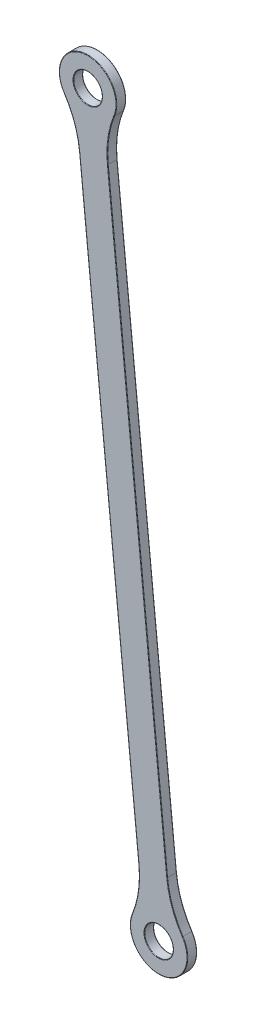
ISO-10303-21;
HEADER;
FILE_DESCRIPTION(('STEP AP214'),'2;1');
FILE_NAME('part.step','',(''),(''),'','','');
FILE_SCHEMA(('AUTOMOTIVE_DESIGN { 1 0 10303 214 1 1 1 1 }'));
ENDSEC;
DATA;
#1=APPLICATION_CONTEXT('core data for automotive mechanical design processes');
#2=APPLICATION_PROTOCOL_DEFINITION('international standard','automotive_design',2000,#1);
#3=PRODUCT_CONTEXT('',#1,'mechanical');
#4=PRODUCT('Part','Part','',(#3));
#5=PRODUCT_RELATED_PRODUCT_CATEGORY('part','',(#4));
#6=PRODUCT_DEFINITION_FORMATION('','',#4);
#7=PRODUCT_DEFINITION_CONTEXT('part definition',#1,'design');
#8=PRODUCT_DEFINITION('design','',#6,#7);
#9=PRODUCT_DEFINITION_SHAPE('','',#8);
#10=(LENGTH_UNIT() NAMED_UNIT(*) SI_UNIT(.MILLI.,.METRE.));
#11=(NAMED_UNIT(*) PLANE_ANGLE_UNIT() SI_UNIT($,.RADIAN.));
#12=(NAMED_UNIT(*) SI_UNIT($,.STERADIAN.) SOLID_ANGLE_UNIT());
#13=UNCERTAINTY_MEASURE_WITH_UNIT(LENGTH_MEASURE(1.E-05),#10,'distance_accuracy_value','');
#14=(GEOMETRIC_REPRESENTATION_CONTEXT(3) GLOBAL_UNCERTAINTY_ASSIGNED_CONTEXT((#13)) GLOBAL_UNIT_ASSIGNED_CONTEXT((#10,
#11,#12)) REPRESENTATION_CONTEXT('',''));
#15=CARTESIAN_POINT('',(0.,0.,0.));
#16=DIRECTION('',(0.,0.,1.));
#17=DIRECTION('',(1.,0.,0.));
#18=AXIS2_PLACEMENT_3D('',#15,#16,#17);
#19=CARTESIAN_POINT('',(26.9745593456508,2.72278490779786,-3.));
#20=DIRECTION('',(-0.994944260506404,-0.100428673621455,0.));
#21=DIRECTION('',(0.100428673621455,-0.994944260506404,0.));
#22=AXIS2_PLACEMENT_3D('',#19,#20,#21);
#23=PLANE('',#22);
#24=DIRECTION('',(0.,0.,-1.));
#25=VECTOR('',#24,1.);
#26=CARTESIAN_POINT('',(17.1507997371631,100.046516135205,-3.));
#27=LINE('',#26,#25);
#28=CARTESIAN_POINT('',(17.1507997371631,100.046516135205,-0.15));
#29=VERTEX_POINT('',#28);
#30=CARTESIAN_POINT('',(17.1507997371631,100.046516135205,-2.85));
#31=VERTEX_POINT('',#30);
#32=EDGE_CURVE('E364',#29,#31,#27,.T.);
#33=ORIENTED_EDGE('',*,*,#32,.T.);
#34=DIRECTION('',(0.100428673621455,-0.994944260506404,0.));
#35=VECTOR('',#34,1.);
#36=CARTESIAN_POINT('',(26.9745593456508,2.72278490779786,-2.85));
#37=LINE('',#36,#35);
#38=CARTESIAN_POINT('',(-1.49146693656855,284.734967759808,-2.85));
#39=VERTEX_POINT('',#38);
#40=EDGE_CURVE('E241',#31,#39,#37,.F.);
#41=ORIENTED_EDGE('',*,*,#40,.T.);
#42=DIRECTION('',(0.,0.,1.));
#43=VECTOR('',#42,1.);
#44=CARTESIAN_POINT('',(-1.49146693656855,284.734967759808,-3.));
#45=LINE('',#44,#43);
#46=CARTESIAN_POINT('',(-1.49146693656855,284.734967759808,-0.15));
#47=VERTEX_POINT('',#46);
#48=EDGE_CURVE('E410',#39,#47,#45,.T.);
#49=ORIENTED_EDGE('',*,*,#48,.T.);
#50=DIRECTION('',(0.100428673621455,-0.994944260506404,0.));
#51=VECTOR('',#50,1.);
#52=CARTESIAN_POINT('',(17.1507997371631,100.046516135205,-0.15));
#53=LINE('',#52,#51);
#54=EDGE_CURVE('E238',#47,#29,#53,.T.);
#55=ORIENTED_EDGE('',*,*,#54,.T.);
#56=EDGE_LOOP('',(#33,#41,#49,#55));
#57=FACE_BOUND('',#56,.T.);
#58=ADVANCED_FACE('F41',(#57),#23,.F.);
#59=CARTESIAN_POINT('',(14.5,81.4999999999992,-3.));
#60=DIRECTION('',(0.,0.,1.));
#61=DIRECTION('',(1.,0.,0.));
#62=AXIS2_PLACEMENT_3D('',#59,#60,#61);
#63=CYLINDRICAL_SURFACE('',#62,9.);
#64=DIRECTION('',(0.,0.,1.));
#65=VECTOR('',#64,1.);
#66=CARTESIAN_POINT('',(6.15722467171074,84.8761071993767,-3.));
#67=LINE('',#66,#65);
#68=CARTESIAN_POINT('',(6.15722467171074,84.8761071993767,-0.15));
#69=VERTEX_POINT('',#68);
#70=CARTESIAN_POINT('',(6.15722467171074,84.8761071993767,-2.85));
#71=VERTEX_POINT('',#70);
#72=EDGE_CURVE('E406',#69,#71,#67,.F.);
#73=ORIENTED_EDGE('',*,*,#72,.T.);
#74=CARTESIAN_POINT('',(14.5,81.4999999999992,-2.85));
#75=DIRECTION('',(0.,0.,1.));
#76=DIRECTION('',(1.,0.,0.));
#77=AXIS2_PLACEMENT_3D('',#74,#75,#76);
#78=CIRCLE('',#77,9.);
#79=CARTESIAN_POINT('',(21.9997986659281,86.4752406947337,-2.85));
#80=VERTEX_POINT('',#79);
#81=EDGE_CURVE('E228',#71,#80,#78,.T.);
#82=ORIENTED_EDGE('',*,*,#81,.T.);
#83=DIRECTION('',(0.,0.,1.));
#84=VECTOR('',#83,1.);
#85=CARTESIAN_POINT('',(21.9997986659281,86.4752406947337,-3.));
#86=LINE('',#85,#84);
#87=CARTESIAN_POINT('',(21.9997986659281,86.4752406947337,-0.15));
#88=VERTEX_POINT('',#87);
#89=EDGE_CURVE('E400',#80,#88,#86,.T.);
#90=ORIENTED_EDGE('',*,*,#89,.T.);
#91=CARTESIAN_POINT('',(14.5,81.4999999999992,-0.15));
#92=DIRECTION('',(0.,0.,1.));
#93=DIRECTION('',(1.,0.,0.));
#94=AXIS2_PLACEMENT_3D('',#91,#92,#93);
#95=CIRCLE('',#94,9.);
#96=EDGE_CURVE('E225',#88,#69,#95,.F.);
#97=ORIENTED_EDGE('',*,*,#96,.T.);
#98=EDGE_LOOP('',(#73,#82,#90,#97));
#99=FACE_BOUND('',#98,.T.);
#100=ADVANCED_FACE('F454',(#99),#63,.T.);
#101=CARTESIAN_POINT('',(18.0200610010932,1.81892684520476,-3.));
#102=DIRECTION('',(-0.994944260506404,-0.100428673621455,0.));
#103=DIRECTION('',(0.100428673621455,-0.994944260506404,0.));
#104=AXIS2_PLACEMENT_3D('',#101,#102,#103);
#105=PLANE('',#104);
#106=DIRECTION('',(0.,0.,-1.));
#107=VECTOR('',#106,1.);
#108=CARTESIAN_POINT('',(-10.4459652811262,283.831109697215,-3.));
#109=LINE('',#108,#107);
#110=CARTESIAN_POINT('',(-10.4459652811262,283.831109697215,-0.15));
#111=VERTEX_POINT('',#110);
#112=CARTESIAN_POINT('',(-10.4459652811262,283.831109697215,-2.85));
#113=VERTEX_POINT('',#112);
#114=EDGE_CURVE('E305',#111,#113,#109,.T.);
#115=ORIENTED_EDGE('',*,*,#114,.T.);
#116=DIRECTION('',(0.100428673621455,-0.994944260506404,0.));
#117=VECTOR('',#116,1.);
#118=CARTESIAN_POINT('',(8.19630139260548,99.1426580726121,-2.85));
#119=LINE('',#118,#117);
#120=CARTESIAN_POINT('',(8.19630139260548,99.1426580726121,-2.85));
#121=VERTEX_POINT('',#120);
#122=EDGE_CURVE('E216',#113,#121,#119,.T.);
#123=ORIENTED_EDGE('',*,*,#122,.T.);
#124=DIRECTION('',(0.,0.,1.));
#125=VECTOR('',#124,1.);
#126=CARTESIAN_POINT('',(8.19630139260548,99.1426580726121,-3.));
#127=LINE('',#126,#125);
#128=CARTESIAN_POINT('',(8.19630139260548,99.1426580726121,-0.15));
#129=VERTEX_POINT('',#128);
#130=EDGE_CURVE('E397',#121,#129,#127,.T.);
#131=ORIENTED_EDGE('',*,*,#130,.T.);
#132=DIRECTION('',(0.100428673621455,-0.994944260506404,0.));
#133=VECTOR('',#132,1.);
#134=CARTESIAN_POINT('',(18.0200610010932,1.81892684520476,-0.15));
#135=LINE('',#134,#133);
#136=EDGE_CURVE('E213',#129,#111,#135,.F.);
#137=ORIENTED_EDGE('',*,*,#136,.T.);
#138=EDGE_LOOP('',(#115,#123,#131,#137));
#139=FACE_BOUND('',#138,.T.);
#140=ADVANCED_FACE('F395',(#139),#105,.T.);
#141=CARTESIAN_POINT('',(14.5,81.4999999999992,-3.));
#142=DIRECTION('',(0.,0.,1.));
#143=DIRECTION('',(1.,0.,0.));
#144=AXIS2_PLACEMENT_3D('',#141,#142,#143);
#145=CYLINDRICAL_SURFACE('',#144,4.5);
#146=CARTESIAN_POINT('',(14.5,81.4999999999992,-2.85));
#147=DIRECTION('',(0.,0.,1.));
#148=DIRECTION('',(1.,0.,0.));
#149=AXIS2_PLACEMENT_3D('',#146,#147,#148);
#150=CIRCLE('',#149,4.5);
#151=CARTESIAN_POINT('',(19.,81.4999999999992,-2.85));
#152=VERTEX_POINT('',#151);
#153=EDGE_CURVE('E204',#152,#152,#150,.F.);
#154=ORIENTED_EDGE('',*,*,#153,.T.);
#155=EDGE_LOOP('',(#154));
#156=FACE_BOUND('',#155,.T.);
#157=CARTESIAN_POINT('',(14.5,81.4999999999992,-0.15));
#158=DIRECTION('',(0.,0.,1.));
#159=DIRECTION('',(1.,0.,0.));
#160=AXIS2_PLACEMENT_3D('',#157,#158,#159);
#161=CIRCLE('',#160,4.5);
#162=CARTESIAN_POINT('',(19.,81.4999999999992,-0.15));
#163=VERTEX_POINT('',#162);
#164=EDGE_CURVE('E200',#163,#163,#161,.T.);
#165=ORIENTED_EDGE('',*,*,#164,.T.);
#166=EDGE_LOOP('',(#165));
#167=FACE_BOUND('',#166,.T.);
#168=ADVANCED_FACE('F706',(#156,#167),#145,.F.);
#169=CARTESIAN_POINT('',(-7.79516554396304,302.377625832421,-3.));
#170=DIRECTION('',(0.,0.,1.));
#171=DIRECTION('',(1.,0.,0.));
#172=AXIS2_PLACEMENT_3D('',#169,#170,#171);
#173=CYLINDRICAL_SURFACE('',#172,9.00000000000001);
#174=DIRECTION('',(0.,0.,1.));
#175=VECTOR('',#174,1.);
#176=CARTESIAN_POINT('',(0.547609784326176,299.001518633043,-3.));
#177=LINE('',#176,#175);
#178=CARTESIAN_POINT('',(0.547609784326176,299.001518633043,-0.15));
#179=VERTEX_POINT('',#178);
#180=CARTESIAN_POINT('',(0.547609784326176,299.001518633043,-2.85));
#181=VERTEX_POINT('',#180);
#182=EDGE_CURVE('E358',#179,#181,#177,.F.);
#183=ORIENTED_EDGE('',*,*,#182,.T.);
#184=CARTESIAN_POINT('',(-7.79516554396304,302.377625832421,-2.85));
#185=DIRECTION('',(0.,0.,1.));
#186=DIRECTION('',(1.,0.,0.));
#187=AXIS2_PLACEMENT_3D('',#184,#185,#186);
#188=CIRCLE('',#187,9.00000000000001);
#189=CARTESIAN_POINT('',(-15.2949642098912,297.402385137686,-2.85));
#190=VERTEX_POINT('',#189);
#191=EDGE_CURVE('E253',#181,#190,#188,.T.);
#192=ORIENTED_EDGE('',*,*,#191,.T.);
#193=DIRECTION('',(0.,0.,1.));
#194=VECTOR('',#193,1.);
#195=CARTESIAN_POINT('',(-15.2949642098912,297.402385137686,-3.));
#196=LINE('',#195,#194);
#197=CARTESIAN_POINT('',(-15.2949642098912,297.402385137686,-0.15));
#198=VERTEX_POINT('',#197);
#199=EDGE_CURVE('E350',#190,#198,#196,.T.);
#200=ORIENTED_EDGE('',*,*,#199,.T.);
#201=CARTESIAN_POINT('',(-7.79516554396304,302.377625832421,-0.15));
#202=DIRECTION('',(0.,0.,1.));
#203=DIRECTION('',(1.,0.,0.));
#204=AXIS2_PLACEMENT_3D('',#201,#202,#203);
#205=CIRCLE('',#204,9.00000000000001);
#206=EDGE_CURVE('E250',#198,#179,#205,.F.);
#207=ORIENTED_EDGE('',*,*,#206,.T.);
#208=EDGE_LOOP('',(#183,#192,#200,#207));
#209=FACE_BOUND('',#208,.T.);
#210=ADVANCED_FACE('F354',(#209),#173,.T.);
#211=CARTESIAN_POINT('',(-7.79516554396304,302.377625832421,-3.));
#212=DIRECTION('',(0.,0.,1.));
#213=DIRECTION('',(1.,0.,0.));
#214=AXIS2_PLACEMENT_3D('',#211,#212,#213);
#215=CYLINDRICAL_SURFACE('',#214,4.5);
#216=CARTESIAN_POINT('',(-7.79516554396304,302.377625832421,-2.85));
#217=DIRECTION('',(0.,0.,1.));
#218=DIRECTION('',(1.,0.,0.));
#219=AXIS2_PLACEMENT_3D('',#216,#217,#218);
#220=CIRCLE('',#219,4.5);
#221=CARTESIAN_POINT('',(-3.29516554396304,302.377625832421,-2.85));
#222=VERTEX_POINT('',#221);
#223=EDGE_CURVE('E179',#222,#222,#220,.F.);
#224=ORIENTED_EDGE('',*,*,#223,.T.);
#225=EDGE_LOOP('',(#224));
#226=FACE_BOUND('',#225,.T.);
#227=CARTESIAN_POINT('',(-7.79516554396304,302.377625832421,-0.15));
#228=DIRECTION('',(0.,0.,1.));
#229=DIRECTION('',(1.,0.,0.));
#230=AXIS2_PLACEMENT_3D('',#227,#228,#229);
#231=CIRCLE('',#230,4.5);
#232=CARTESIAN_POINT('',(-3.29516554396304,302.377625832421,-0.15));
#233=VERTEX_POINT('',#232);
#234=EDGE_CURVE('E357',#233,#233,#231,.T.);
#235=ORIENTED_EDGE('',*,*,#234,.T.);
#236=EDGE_LOOP('',(#235));
#237=FACE_BOUND('',#236,.T.);
#238=ADVANCED_FACE('F684',(#226,#237),#215,.F.);
#239=CARTESIAN_POINT('',(0.,0.,-3.));
#240=DIRECTION('',(0.,0.,1.));
#241=DIRECTION('',(1.,0.,0.));
#242=AXIS2_PLACEMENT_3D('',#239,#240,#241);
#243=PLANE('',#242);
#244=CARTESIAN_POINT('',(-7.79516554396304,302.377625832421,-3.));
#245=DIRECTION('',(0.,0.,1.));
#246=DIRECTION('',(1.,0.,0.));
#247=AXIS2_PLACEMENT_3D('',#244,#245,#246);
#248=CIRCLE('',#247,4.65);
#249=CARTESIAN_POINT('',(-3.14516554396304,302.377625832421,-3.));
#250=VERTEX_POINT('',#249);
#251=EDGE_CURVE('E191',#250,#250,#248,.T.);
#252=ORIENTED_EDGE('',*,*,#251,.T.);
#253=EDGE_LOOP('',(#252));
#254=FACE_BOUND('',#253,.T.);
#255=CARTESIAN_POINT('',(14.5,81.4999999999992,-3.));
#256=DIRECTION('',(0.,0.,1.));
#257=DIRECTION('',(1.,0.,0.));
#258=AXIS2_PLACEMENT_3D('',#255,#256,#257);
#259=CIRCLE('',#258,4.65);
#260=CARTESIAN_POINT('',(19.15,81.4999999999992,-3.));
#261=VERTEX_POINT('',#260);
#262=EDGE_CURVE('E186',#261,#261,#259,.T.);
#263=ORIENTED_EDGE('',*,*,#262,.T.);
#264=EDGE_LOOP('',(#263));
#265=FACE_BOUND('',#264,.T.);
#266=DIRECTION('',(0.100428673621455,-0.994944260506404,0.));
#267=VECTOR('',#266,1.);
#268=CARTESIAN_POINT('',(-10.2967236420502,283.846173998258,-3.));
#269=LINE('',#268,#267);
#270=CARTESIAN_POINT('',(8.34554303168144,99.1577223736553,-3.));
#271=VERTEX_POINT('',#270);
#272=CARTESIAN_POINT('',(-10.2967236420502,283.846173998258,-3.));
#273=VERTEX_POINT('',#272);
#274=EDGE_CURVE('E183',#271,#273,#269,.F.);
#275=ORIENTED_EDGE('',*,*,#274,.T.);
#276=CARTESIAN_POINT('',(-40.2942930963183,280.818249488571,-3.));
#277=DIRECTION('',(0.,0.,1.));
#278=DIRECTION('',(1.,0.,0.));
#279=AXIS2_PLACEMENT_3D('',#276,#277,#278);
#280=CIRCLE('',#279,30.15);
#281=CARTESIAN_POINT('',(-15.169967565459,297.485305815932,-3.));
#282=VERTEX_POINT('',#281);
#283=EDGE_CURVE('E162',#273,#282,#280,.T.);
#284=ORIENTED_EDGE('',*,*,#283,.T.);
#285=CARTESIAN_POINT('',(-7.79516554396304,302.377625832421,-3.));
#286=DIRECTION('',(0.,0.,1.));
#287=DIRECTION('',(1.,0.,0.));
#288=AXIS2_PLACEMENT_3D('',#285,#286,#287);
#289=CIRCLE('',#288,8.85);
#290=CARTESIAN_POINT('',(0.408563528854686,299.057787086366,-3.));
#291=VERTEX_POINT('',#290);
#292=EDGE_CURVE('E171',#282,#291,#289,.F.);
#293=ORIENTED_EDGE('',*,*,#292,.T.);
#294=CARTESIAN_POINT('',(28.3568608786236,287.747827968452,-3.));
#295=DIRECTION('',(0.,0.,1.));
#296=DIRECTION('',(1.,0.,0.));
#297=AXIS2_PLACEMENT_3D('',#294,#295,#296);
#298=CIRCLE('',#297,30.15);
#299=CARTESIAN_POINT('',(-1.64070857564451,284.719903458765,-3.));
#300=VERTEX_POINT('',#299);
#301=EDGE_CURVE('E178',#291,#300,#298,.T.);
#302=ORIENTED_EDGE('',*,*,#301,.T.);
#303=DIRECTION('',(0.100428673621455,-0.994944260506404,0.));
#304=VECTOR('',#303,1.);
#305=CARTESIAN_POINT('',(26.8253177065749,2.70772060675464,-3.));
#306=LINE('',#305,#304);
#307=CARTESIAN_POINT('',(17.0015580980872,100.031451834162,-3.));
#308=VERTEX_POINT('',#307);
#309=EDGE_CURVE('E373',#300,#308,#306,.T.);
#310=ORIENTED_EDGE('',*,*,#309,.T.);
#311=CARTESIAN_POINT('',(46.9991275523552,103.059376343849,-3.));
#312=DIRECTION('',(0.,0.,1.));
#313=DIRECTION('',(1.,0.,0.));
#314=AXIS2_PLACEMENT_3D('',#311,#312,#313);
#315=CIRCLE('',#314,30.15);
#316=CARTESIAN_POINT('',(21.874802021496,86.3923200164881,-3.));
#317=VERTEX_POINT('',#316);
#318=EDGE_CURVE('E376',#308,#317,#315,.T.);
#319=ORIENTED_EDGE('',*,*,#318,.T.);
#320=CARTESIAN_POINT('',(14.5,81.4999999999992,-3.));
#321=DIRECTION('',(0.,0.,1.));
#322=DIRECTION('',(1.,0.,0.));
#323=AXIS2_PLACEMENT_3D('',#320,#321,#322);
#324=CIRCLE('',#323,8.85);
#325=CARTESIAN_POINT('',(6.29627092718222,84.8198387460537,-3.));
#326=VERTEX_POINT('',#325);
#327=EDGE_CURVE('E379',#317,#326,#324,.F.);
#328=ORIENTED_EDGE('',*,*,#327,.T.);
#329=CARTESIAN_POINT('',(-21.6520264225866,96.1297978639685,-3.));
#330=DIRECTION('',(0.,0.,1.));
#331=DIRECTION('',(1.,0.,0.));
#332=AXIS2_PLACEMENT_3D('',#329,#330,#331);
#333=CIRCLE('',#332,30.15);
#334=EDGE_CURVE('E193',#326,#271,#333,.T.);
#335=ORIENTED_EDGE('',*,*,#334,.T.);
#336=EDGE_LOOP('',(#275,#284,#293,#302,#310,#319,#328,#335));
#337=FACE_BOUND('',#336,.T.);
#338=ADVANCED_FACE('F181',(#254,#265,#337),#243,.F.);
#339=CARTESIAN_POINT('',(0.,0.,0.));
#340=DIRECTION('',(0.,0.,1.));
#341=DIRECTION('',(1.,0.,0.));
#342=AXIS2_PLACEMENT_3D('',#339,#340,#341);
#343=PLANE('',#342);
#344=CARTESIAN_POINT('',(-7.79516554396304,302.377625832421,0.));
#345=DIRECTION('',(0.,0.,1.));
#346=DIRECTION('',(1.,0.,0.));
#347=AXIS2_PLACEMENT_3D('',#344,#345,#346);
#348=CIRCLE('',#347,4.65);
#349=CARTESIAN_POINT('',(-3.14516554396304,302.377625832421,0.));
#350=VERTEX_POINT('',#349);
#351=EDGE_CURVE('E11',#350,#350,#348,.F.);
#352=ORIENTED_EDGE('',*,*,#351,.T.);
#353=EDGE_LOOP('',(#352));
#354=FACE_BOUND('',#353,.T.);
#355=CARTESIAN_POINT('',(14.5,81.4999999999992,0.));
#356=DIRECTION('',(0.,0.,1.));
#357=DIRECTION('',(1.,0.,0.));
#358=AXIS2_PLACEMENT_3D('',#355,#356,#357);
#359=CIRCLE('',#358,4.65);
#360=CARTESIAN_POINT('',(19.15,81.4999999999992,0.));
#361=VERTEX_POINT('',#360);
#362=EDGE_CURVE('E51',#361,#361,#359,.F.);
#363=ORIENTED_EDGE('',*,*,#362,.T.);
#364=EDGE_LOOP('',(#363));
#365=FACE_BOUND('',#364,.T.);
#366=CARTESIAN_POINT('',(14.5,81.4999999999992,0.));
#367=DIRECTION('',(0.,0.,1.));
#368=DIRECTION('',(1.,0.,0.));
#369=AXIS2_PLACEMENT_3D('',#366,#367,#368);
#370=CIRCLE('',#369,8.85);
#371=CARTESIAN_POINT('',(6.29627092718223,84.8198387460537,0.));
#372=VERTEX_POINT('',#371);
#373=CARTESIAN_POINT('',(21.874802021496,86.3923200164881,0.));
#374=VERTEX_POINT('',#373);
#375=EDGE_CURVE('E59',#372,#374,#370,.T.);
#376=ORIENTED_EDGE('',*,*,#375,.T.);
#377=CARTESIAN_POINT('',(46.9991275523552,103.059376343849,0.));
#378=DIRECTION('',(0.,0.,1.));
#379=DIRECTION('',(1.,0.,0.));
#380=AXIS2_PLACEMENT_3D('',#377,#378,#379);
#381=CIRCLE('',#380,30.15);
#382=CARTESIAN_POINT('',(17.0015580980872,100.031451834162,0.));
#383=VERTEX_POINT('',#382);
#384=EDGE_CURVE('E275',#374,#383,#381,.F.);
#385=ORIENTED_EDGE('',*,*,#384,.T.);
#386=DIRECTION('',(0.100428673621455,-0.994944260506404,0.));
#387=VECTOR('',#386,1.);
#388=CARTESIAN_POINT('',(-1.64070857564452,284.719903458765,0.));
#389=LINE('',#388,#387);
#390=CARTESIAN_POINT('',(-1.64070857564452,284.719903458765,0.));
#391=VERTEX_POINT('',#390);
#392=EDGE_CURVE('E256',#383,#391,#389,.F.);
#393=ORIENTED_EDGE('',*,*,#392,.T.);
#394=CARTESIAN_POINT('',(28.3568608786236,287.747827968452,0.));
#395=DIRECTION('',(0.,0.,1.));
#396=DIRECTION('',(1.,0.,0.));
#397=AXIS2_PLACEMENT_3D('',#394,#395,#396);
#398=CIRCLE('',#397,30.15);
#399=CARTESIAN_POINT('',(0.408563528854681,299.057787086366,0.));
#400=VERTEX_POINT('',#399);
#401=EDGE_CURVE('E259',#391,#400,#398,.F.);
#402=ORIENTED_EDGE('',*,*,#401,.T.);
#403=CARTESIAN_POINT('',(-7.79516554396304,302.377625832421,0.));
#404=DIRECTION('',(0.,0.,1.));
#405=DIRECTION('',(1.,0.,0.));
#406=AXIS2_PLACEMENT_3D('',#403,#404,#405);
#407=CIRCLE('',#406,8.85);
#408=CARTESIAN_POINT('',(-15.169967565459,297.485305815932,0.));
#409=VERTEX_POINT('',#408);
#410=EDGE_CURVE('E262',#400,#409,#407,.T.);
#411=ORIENTED_EDGE('',*,*,#410,.T.);
#412=CARTESIAN_POINT('',(-40.2942930963183,280.818249488571,0.));
#413=DIRECTION('',(0.,0.,1.));
#414=DIRECTION('',(1.,0.,0.));
#415=AXIS2_PLACEMENT_3D('',#412,#413,#414);
#416=CIRCLE('',#415,30.15);
#417=CARTESIAN_POINT('',(-10.2967236420502,283.846173998258,0.));
#418=VERTEX_POINT('',#417);
#419=EDGE_CURVE('E265',#409,#418,#416,.F.);
#420=ORIENTED_EDGE('',*,*,#419,.T.);
#421=DIRECTION('',(0.100428673621455,-0.994944260506404,0.));
#422=VECTOR('',#421,1.);
#423=CARTESIAN_POINT('',(18.1693026401692,1.83399114624798,0.));
#424=LINE('',#423,#422);
#425=CARTESIAN_POINT('',(8.34554303168144,99.1577223736553,0.));
#426=VERTEX_POINT('',#425);
#427=EDGE_CURVE('E268',#418,#426,#424,.T.);
#428=ORIENTED_EDGE('',*,*,#427,.T.);
#429=CARTESIAN_POINT('',(-21.6520264225866,96.1297978639685,0.));
#430=DIRECTION('',(0.,0.,1.));
#431=DIRECTION('',(1.,0.,0.));
#432=AXIS2_PLACEMENT_3D('',#429,#430,#431);
#433=CIRCLE('',#432,30.15);
#434=EDGE_CURVE('E64',#426,#372,#433,.F.);
#435=ORIENTED_EDGE('',*,*,#434,.T.);
#436=EDGE_LOOP('',(#376,#385,#393,#402,#411,#420,#428,#435));
#437=FACE_BOUND('',#436,.T.);
#438=ADVANCED_FACE('F480',(#354,#365,#437),#343,.T.);
#439=CARTESIAN_POINT('',(-21.6520264225866,96.1297978639685,-3.));
#440=DIRECTION('',(0.,0.,1.));
#441=DIRECTION('',(1.,0.,0.));
#442=AXIS2_PLACEMENT_3D('',#439,#440,#441);
#443=CYLINDRICAL_SURFACE('',#442,30.);
#444=ORIENTED_EDGE('',*,*,#130,.F.);
#445=CARTESIAN_POINT('',(-21.6520264225866,96.1297978639685,-2.85));
#446=DIRECTION('',(0.,0.,1.));
#447=DIRECTION('',(1.,0.,0.));
#448=AXIS2_PLACEMENT_3D('',#445,#446,#447);
#449=CIRCLE('',#448,30.);
#450=EDGE_CURVE('E222',#121,#71,#449,.F.);
#451=ORIENTED_EDGE('',*,*,#450,.T.);
#452=ORIENTED_EDGE('',*,*,#72,.F.);
#453=CARTESIAN_POINT('',(-21.6520264225866,96.1297978639685,-0.15));
#454=DIRECTION('',(0.,0.,1.));
#455=DIRECTION('',(1.,0.,0.));
#456=AXIS2_PLACEMENT_3D('',#453,#454,#455);
#457=CIRCLE('',#456,30.);
#458=EDGE_CURVE('E219',#69,#129,#457,.T.);
#459=ORIENTED_EDGE('',*,*,#458,.T.);
#460=EDGE_LOOP('',(#444,#451,#452,#459));
#461=FACE_BOUND('',#460,.T.);
#462=ADVANCED_FACE('F477',(#461),#443,.F.);
#463=CARTESIAN_POINT('',(46.9991275523552,103.059376343849,-3.));
#464=DIRECTION('',(0.,0.,1.));
#465=DIRECTION('',(1.,0.,0.));
#466=AXIS2_PLACEMENT_3D('',#463,#464,#465);
#467=CYLINDRICAL_SURFACE('',#466,30.);
#468=ORIENTED_EDGE('',*,*,#89,.F.);
#469=CARTESIAN_POINT('',(46.9991275523552,103.059376343849,-2.85));
#470=DIRECTION('',(0.,0.,1.));
#471=DIRECTION('',(1.,0.,0.));
#472=AXIS2_PLACEMENT_3D('',#469,#470,#471);
#473=CIRCLE('',#472,30.);
#474=EDGE_CURVE('E235',#80,#31,#473,.F.);
#475=ORIENTED_EDGE('',*,*,#474,.T.);
#476=ORIENTED_EDGE('',*,*,#32,.F.);
#477=CARTESIAN_POINT('',(46.9991275523552,103.059376343849,-0.15));
#478=DIRECTION('',(0.,0.,1.));
#479=DIRECTION('',(1.,0.,0.));
#480=AXIS2_PLACEMENT_3D('',#477,#478,#479);
#481=CIRCLE('',#480,30.);
#482=EDGE_CURVE('E231',#29,#88,#481,.T.);
#483=ORIENTED_EDGE('',*,*,#482,.T.);
#484=EDGE_LOOP('',(#468,#475,#476,#483));
#485=FACE_BOUND('',#484,.T.);
#486=ADVANCED_FACE('F452',(#485),#467,.F.);
#487=CARTESIAN_POINT('',(-40.2942930963183,280.818249488571,-3.));
#488=DIRECTION('',(0.,0.,1.));
#489=DIRECTION('',(1.,0.,0.));
#490=AXIS2_PLACEMENT_3D('',#487,#488,#489);
#491=CYLINDRICAL_SURFACE('',#490,30.);
#492=ORIENTED_EDGE('',*,*,#199,.F.);
#493=CARTESIAN_POINT('',(-40.2942930963183,280.818249488571,-2.85));
#494=DIRECTION('',(0.,0.,1.));
#495=DIRECTION('',(1.,0.,0.));
#496=AXIS2_PLACEMENT_3D('',#493,#494,#495);
#497=CIRCLE('',#496,30.);
#498=EDGE_CURVE('E164',#190,#113,#497,.F.);
#499=ORIENTED_EDGE('',*,*,#498,.T.);
#500=ORIENTED_EDGE('',*,*,#114,.F.);
#501=CARTESIAN_POINT('',(-40.2942930963183,280.818249488571,-0.15));
#502=DIRECTION('',(0.,0.,1.));
#503=DIRECTION('',(1.,0.,0.));
#504=AXIS2_PLACEMENT_3D('',#501,#502,#503);
#505=CIRCLE('',#504,30.);
#506=EDGE_CURVE('E208',#111,#198,#505,.T.);
#507=ORIENTED_EDGE('',*,*,#506,.T.);
#508=EDGE_LOOP('',(#492,#499,#500,#507));
#509=FACE_BOUND('',#508,.T.);
#510=ADVANCED_FACE('F349',(#509),#491,.F.);
#511=CARTESIAN_POINT('',(28.3568608786236,287.747827968452,-3.));
#512=DIRECTION('',(0.,0.,1.));
#513=DIRECTION('',(1.,0.,0.));
#514=AXIS2_PLACEMENT_3D('',#511,#512,#513);
#515=CYLINDRICAL_SURFACE('',#514,30.);
#516=ORIENTED_EDGE('',*,*,#48,.F.);
#517=CARTESIAN_POINT('',(28.3568608786236,287.747827968452,-2.85));
#518=DIRECTION('',(0.,0.,1.));
#519=DIRECTION('',(1.,0.,0.));
#520=AXIS2_PLACEMENT_3D('',#517,#518,#519);
#521=CIRCLE('',#520,30.);
#522=EDGE_CURVE('E247',#39,#181,#521,.F.);
#523=ORIENTED_EDGE('',*,*,#522,.T.);
#524=ORIENTED_EDGE('',*,*,#182,.F.);
#525=CARTESIAN_POINT('',(28.3568608786236,287.747827968452,-0.15));
#526=DIRECTION('',(0.,0.,1.));
#527=DIRECTION('',(1.,0.,0.));
#528=AXIS2_PLACEMENT_3D('',#525,#526,#527);
#529=CIRCLE('',#528,30.);
#530=EDGE_CURVE('E244',#179,#47,#529,.T.);
#531=ORIENTED_EDGE('',*,*,#530,.T.);
#532=EDGE_LOOP('',(#516,#523,#524,#531));
#533=FACE_BOUND('',#532,.T.);
#534=ADVANCED_FACE('F436',(#533),#515,.F.);
#535=CARTESIAN_POINT('',(-7.79516554396304,302.377625832421,-2.85));
#536=DIRECTION('',(0.,0.,1.));
#537=DIRECTION('',(1.,0.,0.));
#538=AXIS2_PLACEMENT_3D('',#535,#536,#537);
#539=TOROIDAL_SURFACE('',#538,4.65,0.15);
#540=ORIENTED_EDGE('',*,*,#251,.F.);
#541=EDGE_LOOP('',(#540));
#542=FACE_BOUND('',#541,.T.);
#543=ORIENTED_EDGE('',*,*,#223,.F.);
#544=EDGE_LOOP('',(#543));
#545=FACE_BOUND('',#544,.T.);
#546=ADVANCED_FACE('F488',(#542,#545),#539,.T.);
#547=CARTESIAN_POINT('',(14.5,81.4999999999992,-2.85));
#548=DIRECTION('',(0.,0.,1.));
#549=DIRECTION('',(1.,0.,0.));
#550=AXIS2_PLACEMENT_3D('',#547,#548,#549);
#551=TOROIDAL_SURFACE('',#550,4.65,0.15);
#552=ORIENTED_EDGE('',*,*,#153,.F.);
#553=EDGE_LOOP('',(#552));
#554=FACE_BOUND('',#553,.T.);
#555=ORIENTED_EDGE('',*,*,#262,.F.);
#556=EDGE_LOOP('',(#555));
#557=FACE_BOUND('',#556,.T.);
#558=ADVANCED_FACE('F466',(#554,#557),#551,.T.);
#559=CARTESIAN_POINT('',(46.9991275523552,103.059376343849,-2.85));
#560=DIRECTION('',(0.,0.,1.));
#561=DIRECTION('',(1.,0.,0.));
#562=AXIS2_PLACEMENT_3D('',#559,#560,#561);
#563=TOROIDAL_SURFACE('',#562,30.15,0.15);
#564=CARTESIAN_POINT('',(17.0015580980871,100.031451834162,-2.85));
#565=DIRECTION('',(-0.100428673621423,0.994944260506407,0.));
#566=DIRECTION('',(-0.994944260506407,-0.100428673621423,0.));
#567=AXIS2_PLACEMENT_3D('',#564,#565,#566);
#568=CIRCLE('',#567,0.15);
#569=EDGE_CURVE('E297',#31,#308,#568,.T.);
#570=ORIENTED_EDGE('',*,*,#569,.F.);
#571=ORIENTED_EDGE('',*,*,#474,.F.);
#572=CARTESIAN_POINT('',(21.874802021496,86.3923200164881,-2.85));
#573=DIRECTION('',(0.552804521637141,-0.833310962880923,0.));
#574=DIRECTION('',(0.833310962880924,0.552804521637141,0.));
#575=AXIS2_PLACEMENT_3D('',#572,#573,#574);
#576=CIRCLE('',#575,0.15);
#577=EDGE_CURVE('E301',#317,#80,#576,.T.);
#578=ORIENTED_EDGE('',*,*,#577,.F.);
#579=ORIENTED_EDGE('',*,*,#318,.F.);
#580=EDGE_LOOP('',(#570,#571,#578,#579));
#581=FACE_BOUND('',#580,.T.);
#582=ADVANCED_FACE('F426',(#581),#563,.T.);
#583=CARTESIAN_POINT('',(14.5,81.4999999999992,-2.85));
#584=DIRECTION('',(0.,0.,1.));
#585=DIRECTION('',(1.,0.,0.));
#586=AXIS2_PLACEMENT_3D('',#583,#584,#585);
#587=TOROIDAL_SURFACE('',#586,8.85,0.15);
#588=ORIENTED_EDGE('',*,*,#577,.T.);
#589=ORIENTED_EDGE('',*,*,#81,.F.);
#590=CARTESIAN_POINT('',(6.29627092718222,84.8198387460537,-2.85));
#591=DIRECTION('',(0.375123022153069,0.926975036476575,0.));
#592=DIRECTION('',(-0.926975036476575,0.375123022153069,0.));
#593=AXIS2_PLACEMENT_3D('',#590,#591,#592);
#594=CIRCLE('',#593,0.15);
#595=EDGE_CURVE('E293',#326,#71,#594,.T.);
#596=ORIENTED_EDGE('',*,*,#595,.F.);
#597=ORIENTED_EDGE('',*,*,#327,.F.);
#598=EDGE_LOOP('',(#588,#589,#596,#597));
#599=FACE_BOUND('',#598,.T.);
#600=ADVANCED_FACE('F458',(#599),#587,.T.);
#601=CARTESIAN_POINT('',(26.8253177065749,2.70772060675464,-2.85));
#602=DIRECTION('',(0.100428673621455,-0.994944260506404,0.));
#603=DIRECTION('',(0.994944260506404,0.100428673621455,0.));
#604=AXIS2_PLACEMENT_3D('',#601,#602,#603);
#605=CYLINDRICAL_SURFACE('',#604,0.15);
#606=ORIENTED_EDGE('',*,*,#569,.T.);
#607=ORIENTED_EDGE('',*,*,#309,.F.);
#608=CARTESIAN_POINT('',(-1.64070857564451,284.719903458765,-2.85));
#609=DIRECTION('',(-0.100428673621331,0.994944260506417,0.));
#610=DIRECTION('',(-0.994944260506417,-0.100428673621331,0.));
#611=AXIS2_PLACEMENT_3D('',#608,#609,#610);
#612=CIRCLE('',#611,0.15);
#613=EDGE_CURVE('E289',#39,#300,#612,.T.);
#614=ORIENTED_EDGE('',*,*,#613,.F.);
#615=ORIENTED_EDGE('',*,*,#40,.F.);
#616=EDGE_LOOP('',(#606,#607,#614,#615));
#617=FACE_BOUND('',#616,.T.);
#618=ADVANCED_FACE('F431',(#617),#605,.T.);
#619=CARTESIAN_POINT('',(-21.6520264225866,96.1297978639685,-2.85));
#620=DIRECTION('',(0.,0.,1.));
#621=DIRECTION('',(1.,0.,0.));
#622=AXIS2_PLACEMENT_3D('',#619,#620,#621);
#623=TOROIDAL_SURFACE('',#622,30.15,0.15);
#624=ORIENTED_EDGE('',*,*,#595,.T.);
#625=ORIENTED_EDGE('',*,*,#450,.F.);
#626=CARTESIAN_POINT('',(8.34554303168144,99.1577223736553,-2.85));
#627=DIRECTION('',(-0.10042867362142,0.994944260506407,0.));
#628=DIRECTION('',(-0.994944260506408,-0.100428673621421,0.));
#629=AXIS2_PLACEMENT_3D('',#626,#627,#628);
#630=CIRCLE('',#629,0.15);
#631=EDGE_CURVE('E285',#271,#121,#630,.T.);
#632=ORIENTED_EDGE('',*,*,#631,.F.);
#633=ORIENTED_EDGE('',*,*,#334,.F.);
#634=EDGE_LOOP('',(#624,#625,#632,#633));
#635=FACE_BOUND('',#634,.T.);
#636=ADVANCED_FACE('F388',(#635),#623,.T.);
#637=CARTESIAN_POINT('',(28.3568608786236,287.747827968452,-2.85));
#638=DIRECTION('',(0.,0.,1.));
#639=DIRECTION('',(1.,0.,0.));
#640=AXIS2_PLACEMENT_3D('',#637,#638,#639);
#641=TOROIDAL_SURFACE('',#640,30.15,0.15);
#642=ORIENTED_EDGE('',*,*,#613,.T.);
#643=ORIENTED_EDGE('',*,*,#301,.F.);
#644=CARTESIAN_POINT('',(0.40856352885468,299.057787086366,-2.85));
#645=DIRECTION('',(0.375123022153069,0.926975036476575,0.));
#646=DIRECTION('',(-0.926975036476575,0.375123022153069,0.));
#647=AXIS2_PLACEMENT_3D('',#644,#645,#646);
#648=CIRCLE('',#647,0.15);
#649=EDGE_CURVE('E174',#181,#291,#648,.T.);
#650=ORIENTED_EDGE('',*,*,#649,.F.);
#651=ORIENTED_EDGE('',*,*,#522,.F.);
#652=EDGE_LOOP('',(#642,#643,#650,#651));
#653=FACE_BOUND('',#652,.T.);
#654=ADVANCED_FACE('F434',(#653),#641,.T.);
#655=CARTESIAN_POINT('',(18.1693026401692,1.83399114624798,-2.85));
#656=DIRECTION('',(-0.100428673621455,0.994944260506404,0.));
#657=DIRECTION('',(-0.994944260506404,-0.100428673621455,0.));
#658=AXIS2_PLACEMENT_3D('',#655,#656,#657);
#659=CYLINDRICAL_SURFACE('',#658,0.15);
#660=ORIENTED_EDGE('',*,*,#631,.T.);
#661=ORIENTED_EDGE('',*,*,#122,.F.);
#662=CARTESIAN_POINT('',(-10.2967236420502,283.846173998258,-2.85));
#663=DIRECTION('',(-0.100428673621327,0.994944260506417,0.));
#664=DIRECTION('',(-0.994944260506417,-0.100428673621327,0.));
#665=AXIS2_PLACEMENT_3D('',#662,#663,#664);
#666=CIRCLE('',#665,0.15);
#667=EDGE_CURVE('E168',#273,#113,#666,.T.);
#668=ORIENTED_EDGE('',*,*,#667,.F.);
#669=ORIENTED_EDGE('',*,*,#274,.F.);
#670=EDGE_LOOP('',(#660,#661,#668,#669));
#671=FACE_BOUND('',#670,.T.);
#672=ADVANCED_FACE('F391',(#671),#659,.T.);
#673=CARTESIAN_POINT('',(-7.79516554396304,302.377625832421,-2.85));
#674=DIRECTION('',(0.,0.,1.));
#675=DIRECTION('',(1.,0.,0.));
#676=AXIS2_PLACEMENT_3D('',#673,#674,#675);
#677=TOROIDAL_SURFACE('',#676,8.85,0.15);
#678=ORIENTED_EDGE('',*,*,#649,.T.);
#679=ORIENTED_EDGE('',*,*,#292,.F.);
#680=CARTESIAN_POINT('',(-15.169967565459,297.485305815932,-2.85));
#681=DIRECTION('',(0.552804521637087,-0.833310962880959,0.));
#682=DIRECTION('',(0.833310962880959,0.552804521637087,0.));
#683=AXIS2_PLACEMENT_3D('',#680,#681,#682);
#684=CIRCLE('',#683,0.15);
#685=EDGE_CURVE('E158',#190,#282,#684,.T.);
#686=ORIENTED_EDGE('',*,*,#685,.F.);
#687=ORIENTED_EDGE('',*,*,#191,.F.);
#688=EDGE_LOOP('',(#678,#679,#686,#687));
#689=FACE_BOUND('',#688,.T.);
#690=ADVANCED_FACE('F172',(#689),#677,.T.);
#691=CARTESIAN_POINT('',(-40.2942930963183,280.818249488571,-2.85));
#692=DIRECTION('',(0.,0.,1.));
#693=DIRECTION('',(1.,0.,0.));
#694=AXIS2_PLACEMENT_3D('',#691,#692,#693);
#695=TOROIDAL_SURFACE('',#694,30.15,0.15);
#696=ORIENTED_EDGE('',*,*,#667,.T.);
#697=ORIENTED_EDGE('',*,*,#498,.F.);
#698=ORIENTED_EDGE('',*,*,#685,.T.);
#699=ORIENTED_EDGE('',*,*,#283,.F.);
#700=EDGE_LOOP('',(#696,#697,#698,#699));
#701=FACE_BOUND('',#700,.T.);
#702=ADVANCED_FACE('F160',(#701),#695,.T.);
#703=CARTESIAN_POINT('',(-7.79516554396304,302.377625832421,-0.15));
#704=DIRECTION('',(0.,0.,1.));
#705=DIRECTION('',(1.,0.,0.));
#706=AXIS2_PLACEMENT_3D('',#703,#704,#705);
#707=TOROIDAL_SURFACE('',#706,4.65,0.15);
#708=ORIENTED_EDGE('',*,*,#234,.F.);
#709=EDGE_LOOP('',(#708));
#710=FACE_BOUND('',#709,.T.);
#711=ORIENTED_EDGE('',*,*,#351,.F.);
#712=EDGE_LOOP('',(#711));
#713=FACE_BOUND('',#712,.T.);
#714=ADVANCED_FACE('F497',(#710,#713),#707,.T.);
#715=CARTESIAN_POINT('',(14.5,81.4999999999992,-0.15));
#716=DIRECTION('',(0.,0.,1.));
#717=DIRECTION('',(1.,0.,0.));
#718=AXIS2_PLACEMENT_3D('',#715,#716,#717);
#719=TOROIDAL_SURFACE('',#718,4.65,0.15);
#720=ORIENTED_EDGE('',*,*,#362,.F.);
#721=EDGE_LOOP('',(#720));
#722=FACE_BOUND('',#721,.T.);
#723=ORIENTED_EDGE('',*,*,#164,.F.);
#724=EDGE_LOOP('',(#723));
#725=FACE_BOUND('',#724,.T.);
#726=ADVANCED_FACE('F531',(#722,#725),#719,.T.);
#727=CARTESIAN_POINT('',(-40.2942930963183,280.818249488571,-0.15));
#728=DIRECTION('',(0.,0.,1.));
#729=DIRECTION('',(1.,0.,0.));
#730=AXIS2_PLACEMENT_3D('',#727,#728,#729);
#731=TOROIDAL_SURFACE('',#730,30.15,0.15);
#732=CARTESIAN_POINT('',(-15.169967565459,297.485305815932,-0.15));
#733=DIRECTION('',(-0.552804521637087,0.833310962880959,0.));
#734=DIRECTION('',(-0.833310962880959,-0.552804521637087,0.));
#735=AXIS2_PLACEMENT_3D('',#732,#733,#734);
#736=CIRCLE('',#735,0.15);
#737=EDGE_CURVE('E327',#198,#409,#736,.T.);
#738=ORIENTED_EDGE('',*,*,#737,.F.);
#739=ORIENTED_EDGE('',*,*,#506,.F.);
#740=CARTESIAN_POINT('',(-10.2967236420502,283.846173998258,-0.15));
#741=DIRECTION('',(0.100428673621329,-0.994944260506417,0.));
#742=DIRECTION('',(0.994944260506417,0.100428673621329,0.));
#743=AXIS2_PLACEMENT_3D('',#740,#741,#742);
#744=CIRCLE('',#743,0.15);
#745=EDGE_CURVE('E45',#418,#111,#744,.T.);
#746=ORIENTED_EDGE('',*,*,#745,.F.);
#747=ORIENTED_EDGE('',*,*,#419,.F.);
#748=EDGE_LOOP('',(#738,#739,#746,#747));
#749=FACE_BOUND('',#748,.T.);
#750=ADVANCED_FACE('F43',(#749),#731,.T.);
#751=CARTESIAN_POINT('',(18.1693026401692,1.83399114624798,-0.15));
#752=DIRECTION('',(0.100428673621455,-0.994944260506404,0.));
#753=DIRECTION('',(0.994944260506404,0.100428673621455,0.));
#754=AXIS2_PLACEMENT_3D('',#751,#752,#753);
#755=CYLINDRICAL_SURFACE('',#754,0.15);
#756=ORIENTED_EDGE('',*,*,#745,.T.);
#757=ORIENTED_EDGE('',*,*,#136,.F.);
#758=CARTESIAN_POINT('',(8.34554303168144,99.1577223736553,-0.15));
#759=DIRECTION('',(0.100428673621422,-0.994944260506407,0.));
#760=DIRECTION('',(0.994944260506407,0.100428673621422,0.));
#761=AXIS2_PLACEMENT_3D('',#758,#759,#760);
#762=CIRCLE('',#761,0.15);
#763=EDGE_CURVE('E324',#426,#129,#762,.T.);
#764=ORIENTED_EDGE('',*,*,#763,.F.);
#765=ORIENTED_EDGE('',*,*,#427,.F.);
#766=EDGE_LOOP('',(#756,#757,#764,#765));
#767=FACE_BOUND('',#766,.T.);
#768=ADVANCED_FACE('F340',(#767),#755,.T.);
#769=CARTESIAN_POINT('',(-7.79516554396304,302.377625832421,-0.15));
#770=DIRECTION('',(0.,0.,1.));
#771=DIRECTION('',(1.,0.,0.));
#772=AXIS2_PLACEMENT_3D('',#769,#770,#771);
#773=TOROIDAL_SURFACE('',#772,8.85,0.15);
#774=ORIENTED_EDGE('',*,*,#737,.T.);
#775=ORIENTED_EDGE('',*,*,#410,.F.);
#776=CARTESIAN_POINT('',(0.408563528854688,299.057787086366,-0.15));
#777=DIRECTION('',(-0.37512302215307,-0.926975036476575,0.));
#778=DIRECTION('',(0.926975036476575,-0.37512302215307,0.));
#779=AXIS2_PLACEMENT_3D('',#776,#777,#778);
#780=CIRCLE('',#779,0.15);
#781=EDGE_CURVE('E320',#179,#400,#780,.T.);
#782=ORIENTED_EDGE('',*,*,#781,.F.);
#783=ORIENTED_EDGE('',*,*,#206,.F.);
#784=EDGE_LOOP('',(#774,#775,#782,#783));
#785=FACE_BOUND('',#784,.T.);
#786=ADVANCED_FACE('F551',(#785),#773,.T.);
#787=CARTESIAN_POINT('',(-21.6520264225866,96.1297978639685,-0.15));
#788=DIRECTION('',(0.,0.,1.));
#789=DIRECTION('',(1.,0.,0.));
#790=AXIS2_PLACEMENT_3D('',#787,#788,#789);
#791=TOROIDAL_SURFACE('',#790,30.15,0.15);
#792=ORIENTED_EDGE('',*,*,#763,.T.);
#793=ORIENTED_EDGE('',*,*,#458,.F.);
#794=CARTESIAN_POINT('',(6.29627092718223,84.8198387460537,-0.15));
#795=DIRECTION('',(-0.375123022153069,-0.926975036476575,0.));
#796=DIRECTION('',(0.926975036476575,-0.375123022153069,0.));
#797=AXIS2_PLACEMENT_3D('',#794,#795,#796);
#798=CIRCLE('',#797,0.15);
#799=EDGE_CURVE('E316',#372,#69,#798,.T.);
#800=ORIENTED_EDGE('',*,*,#799,.F.);
#801=ORIENTED_EDGE('',*,*,#434,.F.);
#802=EDGE_LOOP('',(#792,#793,#800,#801));
#803=FACE_BOUND('',#802,.T.);
#804=ADVANCED_FACE('F557',(#803),#791,.T.);
#805=CARTESIAN_POINT('',(28.3568608786236,287.747827968452,-0.15));
#806=DIRECTION('',(0.,0.,1.));
#807=DIRECTION('',(1.,0.,0.));
#808=AXIS2_PLACEMENT_3D('',#805,#806,#807);
#809=TOROIDAL_SURFACE('',#808,30.15,0.15);
#810=ORIENTED_EDGE('',*,*,#781,.T.);
#811=ORIENTED_EDGE('',*,*,#401,.F.);
#812=CARTESIAN_POINT('',(-1.64070857564451,284.719903458765,-0.15));
#813=DIRECTION('',(0.100428673621331,-0.994944260506417,0.));
#814=DIRECTION('',(0.994944260506417,0.100428673621331,0.));
#815=AXIS2_PLACEMENT_3D('',#812,#813,#814);
#816=CIRCLE('',#815,0.15);
#817=EDGE_CURVE('E312',#47,#391,#816,.T.);
#818=ORIENTED_EDGE('',*,*,#817,.F.);
#819=ORIENTED_EDGE('',*,*,#530,.F.);
#820=EDGE_LOOP('',(#810,#811,#818,#819));
#821=FACE_BOUND('',#820,.T.);
#822=ADVANCED_FACE('F442',(#821),#809,.T.);
#823=CARTESIAN_POINT('',(14.5,81.4999999999992,-0.15));
#824=DIRECTION('',(0.,0.,1.));
#825=DIRECTION('',(1.,0.,0.));
#826=AXIS2_PLACEMENT_3D('',#823,#824,#825);
#827=TOROIDAL_SURFACE('',#826,8.85,0.15);
#828=ORIENTED_EDGE('',*,*,#799,.T.);
#829=ORIENTED_EDGE('',*,*,#96,.F.);
#830=CARTESIAN_POINT('',(21.874802021496,86.3923200164881,-0.15));
#831=DIRECTION('',(-0.552804521637141,0.833310962880923,0.));
#832=DIRECTION('',(-0.833310962880924,-0.552804521637141,0.));
#833=AXIS2_PLACEMENT_3D('',#830,#831,#832);
#834=CIRCLE('',#833,0.15);
#835=EDGE_CURVE('E309',#374,#88,#834,.T.);
#836=ORIENTED_EDGE('',*,*,#835,.F.);
#837=ORIENTED_EDGE('',*,*,#375,.F.);
#838=EDGE_LOOP('',(#828,#829,#836,#837));
#839=FACE_BOUND('',#838,.T.);
#840=ADVANCED_FACE('F571',(#839),#827,.T.);
#841=CARTESIAN_POINT('',(26.8253177065749,2.70772060675464,-0.15));
#842=DIRECTION('',(-0.100428673621455,0.994944260506404,0.));
#843=DIRECTION('',(-0.994944260506404,-0.100428673621455,0.));
#844=AXIS2_PLACEMENT_3D('',#841,#842,#843);
#845=CYLINDRICAL_SURFACE('',#844,0.15);
#846=ORIENTED_EDGE('',*,*,#817,.T.);
#847=ORIENTED_EDGE('',*,*,#392,.F.);
#848=CARTESIAN_POINT('',(17.0015580980872,100.031451834162,-0.15));
#849=DIRECTION('',(0.100428673621423,-0.994944260506407,0.));
#850=DIRECTION('',(0.994944260506407,0.100428673621423,0.));
#851=AXIS2_PLACEMENT_3D('',#848,#849,#850);
#852=CIRCLE('',#851,0.15);
#853=EDGE_CURVE('E306',#29,#383,#852,.T.);
#854=ORIENTED_EDGE('',*,*,#853,.F.);
#855=ORIENTED_EDGE('',*,*,#54,.F.);
#856=EDGE_LOOP('',(#846,#847,#854,#855));
#857=FACE_BOUND('',#856,.T.);
#858=ADVANCED_FACE('F446',(#857),#845,.T.);
#859=CARTESIAN_POINT('',(46.9991275523552,103.059376343849,-0.15));
#860=DIRECTION('',(0.,0.,1.));
#861=DIRECTION('',(1.,0.,0.));
#862=AXIS2_PLACEMENT_3D('',#859,#860,#861);
#863=TOROIDAL_SURFACE('',#862,30.15,0.15);
#864=ORIENTED_EDGE('',*,*,#835,.T.);
#865=ORIENTED_EDGE('',*,*,#482,.F.);
#866=ORIENTED_EDGE('',*,*,#853,.T.);
#867=ORIENTED_EDGE('',*,*,#384,.F.);
#868=EDGE_LOOP('',(#864,#865,#866,#867));
#869=FACE_BOUND('',#868,.T.);
#870=ADVANCED_FACE('F449',(#869),#863,.T.);
#871=CLOSED_SHELL('',(#58,#100,#140,#168,#210,#238,#338,#438,#462,#486,#510,#534,#546,#558,#582,
#600,#618,#636,#654,#672,#690,#702,#714,#726,#750,#768,#786,#804,#822,#840,#858,#870));
#872=MANIFOLD_SOLID_BREP('B2',#871);
#873=ADVANCED_BREP_SHAPE_REPRESENTATION('',(#18,#872),#14);
#874=SHAPE_DEFINITION_REPRESENTATION(#9,#873);
ENDSEC;
END-ISO-10303-21;
